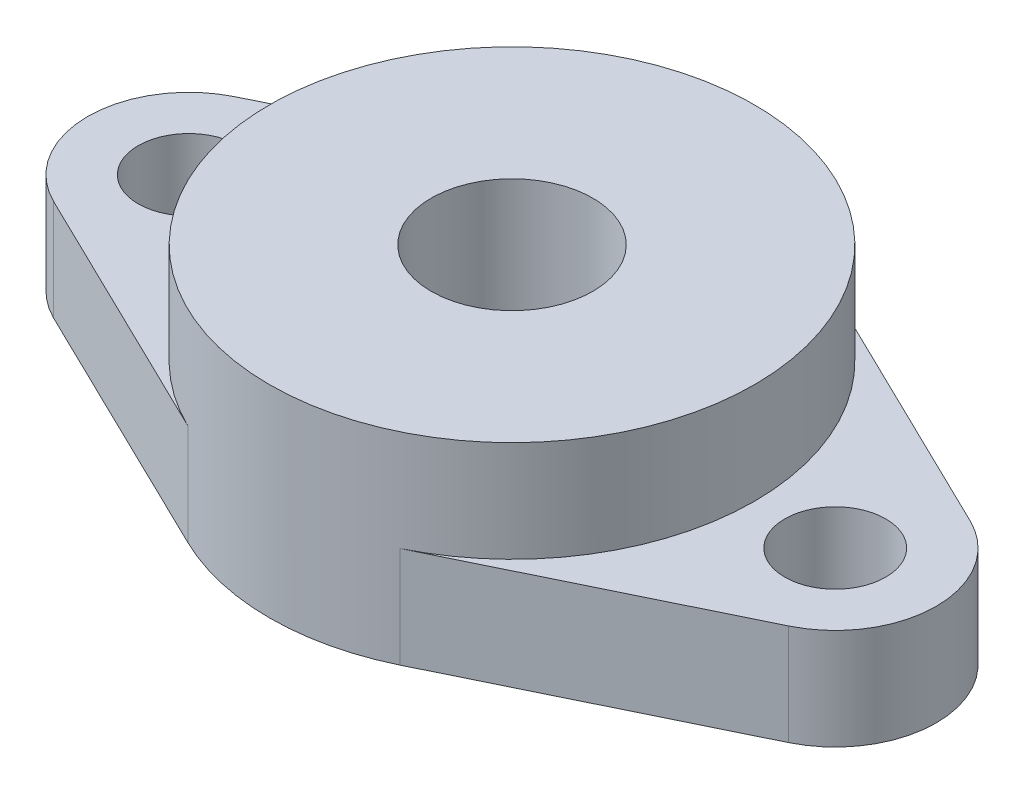
ISO-10303-21;
HEADER;
FILE_DESCRIPTION(('STEP AP214'),'2;1');
FILE_NAME('part.step','',(''),(''),'','','');
FILE_SCHEMA(('AUTOMOTIVE_DESIGN { 1 0 10303 214 1 1 1 1 }'));
ENDSEC;
DATA;
#1=APPLICATION_CONTEXT('core data for automotive mechanical design processes');
#2=APPLICATION_PROTOCOL_DEFINITION('international standard','automotive_design',2000,#1);
#3=PRODUCT_CONTEXT('',#1,'mechanical');
#4=PRODUCT('Part','Part','',(#3));
#5=PRODUCT_RELATED_PRODUCT_CATEGORY('part','',(#4));
#6=PRODUCT_DEFINITION_FORMATION('','',#4);
#7=PRODUCT_DEFINITION_CONTEXT('part definition',#1,'design');
#8=PRODUCT_DEFINITION('design','',#6,#7);
#9=PRODUCT_DEFINITION_SHAPE('','',#8);
#10=(LENGTH_UNIT() NAMED_UNIT(*) SI_UNIT(.MILLI.,.METRE.));
#11=(NAMED_UNIT(*) PLANE_ANGLE_UNIT() SI_UNIT($,.RADIAN.));
#12=(NAMED_UNIT(*) SI_UNIT($,.STERADIAN.) SOLID_ANGLE_UNIT());
#13=UNCERTAINTY_MEASURE_WITH_UNIT(LENGTH_MEASURE(1.E-05),#10,'distance_accuracy_value','');
#14=(GEOMETRIC_REPRESENTATION_CONTEXT(3) GLOBAL_UNCERTAINTY_ASSIGNED_CONTEXT((#13)) GLOBAL_UNIT_ASSIGNED_CONTEXT((#10,
#11,#12)) REPRESENTATION_CONTEXT('',''));
#15=CARTESIAN_POINT('',(0.,0.,0.));
#16=DIRECTION('',(0.,0.,1.));
#17=DIRECTION('',(1.,0.,0.));
#18=AXIS2_PLACEMENT_3D('',#15,#16,#17);
#19=CARTESIAN_POINT('',(0.,5.,0.));
#20=DIRECTION('',(0.,1.,0.));
#21=DIRECTION('',(0.,0.,1.));
#22=AXIS2_PLACEMENT_3D('',#19,#20,#21);
#23=PLANE('',#22);
#24=CARTESIAN_POINT('',(16.,5.,0.));
#25=DIRECTION('',(0.,1.,0.));
#26=DIRECTION('',(0.,0.,1.));
#27=AXIS2_PLACEMENT_3D('',#24,#25,#26);
#28=CIRCLE('',#27,2.5);
#29=CARTESIAN_POINT('',(16.,5.,2.5));
#30=VERTEX_POINT('',#29);
#31=EDGE_CURVE('E225',#30,#30,#28,.T.);
#32=ORIENTED_EDGE('',*,*,#31,.F.);
#33=EDGE_LOOP('',(#32));
#34=FACE_BOUND('',#33,.T.);
#35=CARTESIAN_POINT('',(0.,5.,0.));
#36=DIRECTION('',(0.,1.,0.));
#37=DIRECTION('',(0.,0.,1.));
#38=AXIS2_PLACEMENT_3D('',#35,#36,#37);
#39=CIRCLE('',#38,12.);
#40=CARTESIAN_POINT('',(5.25,5.,10.7906209274536));
#41=VERTEX_POINT('',#40);
#42=CARTESIAN_POINT('',(5.25,5.,-10.7906209274536));
#43=VERTEX_POINT('',#42);
#44=EDGE_CURVE('E51',#41,#43,#39,.T.);
#45=ORIENTED_EDGE('',*,*,#44,.F.);
#46=DIRECTION('',(0.899218410621135,0.,-0.4375));
#47=VECTOR('',#46,1.);
#48=CARTESIAN_POINT('',(18.1875,5.,4.49609205310567));
#49=LINE('',#48,#47);
#50=CARTESIAN_POINT('',(18.1875,5.,4.49609205310567));
#51=VERTEX_POINT('',#50);
#52=EDGE_CURVE('E113',#41,#51,#49,.T.);
#53=ORIENTED_EDGE('',*,*,#52,.T.);
#54=CARTESIAN_POINT('',(16.,5.,0.));
#55=DIRECTION('',(0.,1.,0.));
#56=DIRECTION('',(0.,0.,-1.));
#57=AXIS2_PLACEMENT_3D('',#54,#55,#56);
#58=CIRCLE('',#57,5.);
#59=CARTESIAN_POINT('',(18.1875,5.,-4.49609205310567));
#60=VERTEX_POINT('',#59);
#61=EDGE_CURVE('E116',#51,#60,#58,.T.);
#62=ORIENTED_EDGE('',*,*,#61,.T.);
#63=DIRECTION('',(-0.899218410621135,0.,-0.4375));
#64=VECTOR('',#63,1.);
#65=CARTESIAN_POINT('',(5.25,5.,-10.7906209274536));
#66=LINE('',#65,#64);
#67=EDGE_CURVE('E59',#60,#43,#66,.T.);
#68=ORIENTED_EDGE('',*,*,#67,.T.);
#69=EDGE_LOOP('',(#45,#53,#62,#68));
#70=FACE_BOUND('',#69,.T.);
#71=ADVANCED_FACE('F39',(#34,#70),#23,.T.);
#72=CARTESIAN_POINT('',(-5.25,5.,-10.7906209274536));
#73=DIRECTION('',(0.4375,0.,0.899218410621135));
#74=DIRECTION('',(0.899218410621135,0.,-0.4375));
#75=AXIS2_PLACEMENT_3D('',#72,#73,#74);
#76=PLANE('',#75);
#77=DIRECTION('',(-0.899218410621135,0.,0.4375));
#78=VECTOR('',#77,1.);
#79=CARTESIAN_POINT('',(-5.25,0.,-10.7906209274536));
#80=LINE('',#79,#78);
#81=CARTESIAN_POINT('',(-5.25,0.,-10.7906209274536));
#82=VERTEX_POINT('',#81);
#83=CARTESIAN_POINT('',(-18.1875,0.,-4.49609205310567));
#84=VERTEX_POINT('',#83);
#85=EDGE_CURVE('E144',#82,#84,#80,.T.);
#86=ORIENTED_EDGE('',*,*,#85,.T.);
#87=DIRECTION('',(0.,-1.,0.));
#88=VECTOR('',#87,1.);
#89=CARTESIAN_POINT('',(-18.1875,5.,-4.49609205310567));
#90=LINE('',#89,#88);
#91=CARTESIAN_POINT('',(-18.1875,5.,-4.49609205310567));
#92=VERTEX_POINT('',#91);
#93=EDGE_CURVE('E177',#92,#84,#90,.T.);
#94=ORIENTED_EDGE('',*,*,#93,.F.);
#95=DIRECTION('',(-0.899218410621135,0.,0.4375));
#96=VECTOR('',#95,1.);
#97=CARTESIAN_POINT('',(-5.25,5.,-10.7906209274536));
#98=LINE('',#97,#96);
#99=CARTESIAN_POINT('',(-5.25,5.,-10.7906209274536));
#100=VERTEX_POINT('',#99);
#101=EDGE_CURVE('E163',#100,#92,#98,.T.);
#102=ORIENTED_EDGE('',*,*,#101,.F.);
#103=DIRECTION('',(0.,-1.,0.));
#104=VECTOR('',#103,1.);
#105=CARTESIAN_POINT('',(-5.25,5.,-10.7906209274536));
#106=LINE('',#105,#104);
#107=EDGE_CURVE('E43',#100,#82,#106,.T.);
#108=ORIENTED_EDGE('',*,*,#107,.T.);
#109=EDGE_LOOP('',(#86,#94,#102,#108));
#110=FACE_BOUND('',#109,.T.);
#111=ADVANCED_FACE('F41',(#110),#76,.F.);
#112=CARTESIAN_POINT('',(-16.,5.,0.));
#113=DIRECTION('',(0.,-1.,0.));
#114=DIRECTION('',(0.,0.,-1.));
#115=AXIS2_PLACEMENT_3D('',#112,#113,#114);
#116=CYLINDRICAL_SURFACE('',#115,5.);
#117=CARTESIAN_POINT('',(-16.,0.,0.));
#118=DIRECTION('',(0.,1.,0.));
#119=DIRECTION('',(0.,0.,1.));
#120=AXIS2_PLACEMENT_3D('',#117,#118,#119);
#121=CIRCLE('',#120,5.);
#122=CARTESIAN_POINT('',(-18.1875,0.,4.49609205310567));
#123=VERTEX_POINT('',#122);
#124=EDGE_CURVE('E148',#84,#123,#121,.T.);
#125=ORIENTED_EDGE('',*,*,#124,.T.);
#126=DIRECTION('',(0.,-1.,0.));
#127=VECTOR('',#126,1.);
#128=CARTESIAN_POINT('',(-18.1875,5.,4.49609205310567));
#129=LINE('',#128,#127);
#130=CARTESIAN_POINT('',(-18.1875,5.,4.49609205310567));
#131=VERTEX_POINT('',#130);
#132=EDGE_CURVE('E174',#131,#123,#129,.T.);
#133=ORIENTED_EDGE('',*,*,#132,.F.);
#134=CARTESIAN_POINT('',(-16.,5.,0.));
#135=DIRECTION('',(0.,1.,0.));
#136=DIRECTION('',(0.,0.,1.));
#137=AXIS2_PLACEMENT_3D('',#134,#135,#136);
#138=CIRCLE('',#137,5.);
#139=EDGE_CURVE('E203',#92,#131,#138,.T.);
#140=ORIENTED_EDGE('',*,*,#139,.F.);
#141=ORIENTED_EDGE('',*,*,#93,.T.);
#142=EDGE_LOOP('',(#125,#133,#140,#141));
#143=FACE_BOUND('',#142,.T.);
#144=ADVANCED_FACE('F197',(#143),#116,.T.);
#145=CARTESIAN_POINT('',(-18.1875,5.,4.49609205310567));
#146=DIRECTION('',(0.4375,0.,-0.899218410621135));
#147=DIRECTION('',(-0.899218410621135,0.,-0.4375));
#148=AXIS2_PLACEMENT_3D('',#145,#146,#147);
#149=PLANE('',#148);
#150=DIRECTION('',(0.899218410621135,0.,0.4375));
#151=VECTOR('',#150,1.);
#152=CARTESIAN_POINT('',(-18.1875,0.,4.49609205310567));
#153=LINE('',#152,#151);
#154=CARTESIAN_POINT('',(-5.25,0.,10.7906209274536));
#155=VERTEX_POINT('',#154);
#156=EDGE_CURVE('E151',#123,#155,#153,.T.);
#157=ORIENTED_EDGE('',*,*,#156,.T.);
#158=DIRECTION('',(0.,-1.,0.));
#159=VECTOR('',#158,1.);
#160=CARTESIAN_POINT('',(-5.25,5.,10.7906209274536));
#161=LINE('',#160,#159);
#162=CARTESIAN_POINT('',(-5.25,5.,10.7906209274536));
#163=VERTEX_POINT('',#162);
#164=EDGE_CURVE('E170',#163,#155,#161,.T.);
#165=ORIENTED_EDGE('',*,*,#164,.F.);
#166=DIRECTION('',(0.899218410621135,0.,0.4375));
#167=VECTOR('',#166,1.);
#168=CARTESIAN_POINT('',(-18.1875,5.,4.49609205310567));
#169=LINE('',#168,#167);
#170=EDGE_CURVE('E122',#131,#163,#169,.T.);
#171=ORIENTED_EDGE('',*,*,#170,.F.);
#172=ORIENTED_EDGE('',*,*,#132,.T.);
#173=EDGE_LOOP('',(#157,#165,#171,#172));
#174=FACE_BOUND('',#173,.T.);
#175=ADVANCED_FACE('F200',(#174),#149,.F.);
#176=CARTESIAN_POINT('',(0.,5.,0.));
#177=DIRECTION('',(0.,-1.,0.));
#178=DIRECTION('',(0.,0.,-1.));
#179=AXIS2_PLACEMENT_3D('',#176,#177,#178);
#180=CYLINDRICAL_SURFACE('',#179,12.);
#181=CARTESIAN_POINT('',(0.,0.,0.));
#182=DIRECTION('',(0.,1.,0.));
#183=DIRECTION('',(0.,0.,1.));
#184=AXIS2_PLACEMENT_3D('',#181,#182,#183);
#185=CIRCLE('',#184,12.);
#186=CARTESIAN_POINT('',(5.25,0.,10.7906209274536));
#187=VERTEX_POINT('',#186);
#188=EDGE_CURVE('E154',#155,#187,#185,.T.);
#189=ORIENTED_EDGE('',*,*,#188,.T.);
#190=DIRECTION('',(0.,-1.,0.));
#191=VECTOR('',#190,1.);
#192=CARTESIAN_POINT('',(5.25,5.,10.7906209274536));
#193=LINE('',#192,#191);
#194=EDGE_CURVE('E129',#41,#187,#193,.T.);
#195=ORIENTED_EDGE('',*,*,#194,.F.);
#196=ORIENTED_EDGE('',*,*,#44,.T.);
#197=DIRECTION('',(0.,-1.,0.));
#198=VECTOR('',#197,1.);
#199=CARTESIAN_POINT('',(5.25,5.,-10.7906209274536));
#200=LINE('',#199,#198);
#201=CARTESIAN_POINT('',(5.25,0.,-10.7906209274536));
#202=VERTEX_POINT('',#201);
#203=EDGE_CURVE('E136',#43,#202,#200,.T.);
#204=ORIENTED_EDGE('',*,*,#203,.T.);
#205=CARTESIAN_POINT('',(0.,0.,0.));
#206=DIRECTION('',(0.,1.,0.));
#207=DIRECTION('',(0.,0.,1.));
#208=AXIS2_PLACEMENT_3D('',#205,#206,#207);
#209=CIRCLE('',#208,12.);
#210=EDGE_CURVE('E140',#202,#82,#209,.T.);
#211=ORIENTED_EDGE('',*,*,#210,.T.);
#212=ORIENTED_EDGE('',*,*,#107,.F.);
#213=EDGE_CURVE('E11',#100,#163,#39,.T.);
#214=ORIENTED_EDGE('',*,*,#213,.T.);
#215=ORIENTED_EDGE('',*,*,#164,.T.);
#216=EDGE_LOOP('',(#189,#195,#196,#204,#211,#212,#214,#215));
#217=FACE_BOUND('',#216,.T.);
#218=CARTESIAN_POINT('',(0.,10.,0.));
#219=DIRECTION('',(0.,1.,0.));
#220=DIRECTION('',(0.,0.,1.));
#221=AXIS2_PLACEMENT_3D('',#218,#219,#220);
#222=CIRCLE('',#221,12.);
#223=CARTESIAN_POINT('',(0.,10.,12.));
#224=VERTEX_POINT('',#223);
#225=EDGE_CURVE('E145',#224,#224,#222,.T.);
#226=ORIENTED_EDGE('',*,*,#225,.F.);
#227=EDGE_LOOP('',(#226));
#228=FACE_BOUND('',#227,.T.);
#229=ADVANCED_FACE('F190',(#217,#228),#180,.T.);
#230=CARTESIAN_POINT('',(18.1875,5.,4.49609205310567));
#231=DIRECTION('',(-0.4375,0.,-0.899218410621135));
#232=DIRECTION('',(-0.899218410621135,0.,0.4375));
#233=AXIS2_PLACEMENT_3D('',#230,#231,#232);
#234=PLANE('',#233);
#235=DIRECTION('',(0.899218410621135,0.,-0.4375));
#236=VECTOR('',#235,1.);
#237=CARTESIAN_POINT('',(18.1875,0.,4.49609205310567));
#238=LINE('',#237,#236);
#239=CARTESIAN_POINT('',(18.1875,0.,4.49609205310567));
#240=VERTEX_POINT('',#239);
#241=EDGE_CURVE('E127',#187,#240,#238,.T.);
#242=ORIENTED_EDGE('',*,*,#241,.T.);
#243=DIRECTION('',(0.,-1.,0.));
#244=VECTOR('',#243,1.);
#245=CARTESIAN_POINT('',(18.1875,5.,4.49609205310567));
#246=LINE('',#245,#244);
#247=EDGE_CURVE('E124',#51,#240,#246,.T.);
#248=ORIENTED_EDGE('',*,*,#247,.F.);
#249=ORIENTED_EDGE('',*,*,#52,.F.);
#250=ORIENTED_EDGE('',*,*,#194,.T.);
#251=EDGE_LOOP('',(#242,#248,#249,#250));
#252=FACE_BOUND('',#251,.T.);
#253=ADVANCED_FACE('F125',(#252),#234,.F.);
#254=CARTESIAN_POINT('',(16.,5.,0.));
#255=DIRECTION('',(0.,-1.,0.));
#256=DIRECTION('',(0.,0.,-1.));
#257=AXIS2_PLACEMENT_3D('',#254,#255,#256);
#258=CYLINDRICAL_SURFACE('',#257,5.);
#259=CARTESIAN_POINT('',(16.,0.,0.));
#260=DIRECTION('',(0.,1.,0.));
#261=DIRECTION('',(0.,0.,-1.));
#262=AXIS2_PLACEMENT_3D('',#259,#260,#261);
#263=CIRCLE('',#262,5.);
#264=CARTESIAN_POINT('',(18.1875,0.,-4.49609205310567));
#265=VERTEX_POINT('',#264);
#266=EDGE_CURVE('E89',#240,#265,#263,.T.);
#267=ORIENTED_EDGE('',*,*,#266,.T.);
#268=DIRECTION('',(0.,-1.,0.));
#269=VECTOR('',#268,1.);
#270=CARTESIAN_POINT('',(18.1875,5.,-4.49609205310567));
#271=LINE('',#270,#269);
#272=EDGE_CURVE('E130',#60,#265,#271,.T.);
#273=ORIENTED_EDGE('',*,*,#272,.F.);
#274=ORIENTED_EDGE('',*,*,#61,.F.);
#275=ORIENTED_EDGE('',*,*,#247,.T.);
#276=EDGE_LOOP('',(#267,#273,#274,#275));
#277=FACE_BOUND('',#276,.T.);
#278=ADVANCED_FACE('F132',(#277),#258,.T.);
#279=CARTESIAN_POINT('',(5.25,5.,-10.7906209274536));
#280=DIRECTION('',(-0.4375,0.,0.899218410621135));
#281=DIRECTION('',(0.899218410621135,0.,0.4375));
#282=AXIS2_PLACEMENT_3D('',#279,#280,#281);
#283=PLANE('',#282);
#284=DIRECTION('',(-0.899218410621135,0.,-0.4375));
#285=VECTOR('',#284,1.);
#286=CARTESIAN_POINT('',(5.25,0.,-10.7906209274536));
#287=LINE('',#286,#285);
#288=EDGE_CURVE('E95',#265,#202,#287,.T.);
#289=ORIENTED_EDGE('',*,*,#288,.T.);
#290=ORIENTED_EDGE('',*,*,#203,.F.);
#291=ORIENTED_EDGE('',*,*,#67,.F.);
#292=ORIENTED_EDGE('',*,*,#272,.T.);
#293=EDGE_LOOP('',(#289,#290,#291,#292));
#294=FACE_BOUND('',#293,.T.);
#295=ADVANCED_FACE('F276',(#294),#283,.F.);
#296=CARTESIAN_POINT('',(-16.,5.,0.));
#297=DIRECTION('',(0.,1.,0.));
#298=DIRECTION('',(0.,0.,1.));
#299=AXIS2_PLACEMENT_3D('',#296,#297,#298);
#300=CIRCLE('',#299,2.5);
#301=CARTESIAN_POINT('',(-16.,5.,2.5));
#302=VERTEX_POINT('',#301);
#303=EDGE_CURVE('E218',#302,#302,#300,.T.);
#304=ORIENTED_EDGE('',*,*,#303,.F.);
#305=EDGE_LOOP('',(#304));
#306=FACE_BOUND('',#305,.T.);
#307=ORIENTED_EDGE('',*,*,#213,.F.);
#308=ORIENTED_EDGE('',*,*,#101,.T.);
#309=ORIENTED_EDGE('',*,*,#139,.T.);
#310=ORIENTED_EDGE('',*,*,#170,.T.);
#311=EDGE_LOOP('',(#307,#308,#309,#310));
#312=FACE_BOUND('',#311,.T.);
#313=ADVANCED_FACE('F243',(#306,#312),#23,.T.);
#314=CARTESIAN_POINT('',(0.,0.,0.));
#315=DIRECTION('',(0.,1.,0.));
#316=DIRECTION('',(0.,0.,1.));
#317=AXIS2_PLACEMENT_3D('',#314,#315,#316);
#318=PLANE('',#317);
#319=CARTESIAN_POINT('',(-16.,0.,0.));
#320=DIRECTION('',(0.,-1.,0.));
#321=DIRECTION('',(0.,0.,-1.));
#322=AXIS2_PLACEMENT_3D('',#319,#320,#321);
#323=CIRCLE('',#322,2.5);
#324=CARTESIAN_POINT('',(-16.,0.,-2.5));
#325=VERTEX_POINT('',#324);
#326=EDGE_CURVE('E229',#325,#325,#323,.T.);
#327=ORIENTED_EDGE('',*,*,#326,.F.);
#328=EDGE_LOOP('',(#327));
#329=FACE_BOUND('',#328,.T.);
#330=CARTESIAN_POINT('',(16.,0.,0.));
#331=DIRECTION('',(0.,-1.,0.));
#332=DIRECTION('',(0.,0.,-1.));
#333=AXIS2_PLACEMENT_3D('',#330,#331,#332);
#334=CIRCLE('',#333,2.5);
#335=CARTESIAN_POINT('',(16.,0.,-2.5));
#336=VERTEX_POINT('',#335);
#337=EDGE_CURVE('E230',#336,#336,#334,.T.);
#338=ORIENTED_EDGE('',*,*,#337,.F.);
#339=EDGE_LOOP('',(#338));
#340=FACE_BOUND('',#339,.T.);
#341=CARTESIAN_POINT('',(0.,0.,0.));
#342=DIRECTION('',(0.,1.,0.));
#343=DIRECTION('',(0.,0.,1.));
#344=AXIS2_PLACEMENT_3D('',#341,#342,#343);
#345=CIRCLE('',#344,4.);
#346=CARTESIAN_POINT('',(0.,0.,4.));
#347=VERTEX_POINT('',#346);
#348=EDGE_CURVE('E210',#347,#347,#345,.T.);
#349=ORIENTED_EDGE('',*,*,#348,.T.);
#350=EDGE_LOOP('',(#349));
#351=FACE_BOUND('',#350,.T.);
#352=ORIENTED_EDGE('',*,*,#210,.F.);
#353=ORIENTED_EDGE('',*,*,#288,.F.);
#354=ORIENTED_EDGE('',*,*,#266,.F.);
#355=ORIENTED_EDGE('',*,*,#241,.F.);
#356=ORIENTED_EDGE('',*,*,#188,.F.);
#357=ORIENTED_EDGE('',*,*,#156,.F.);
#358=ORIENTED_EDGE('',*,*,#124,.F.);
#359=ORIENTED_EDGE('',*,*,#85,.F.);
#360=EDGE_LOOP('',(#352,#353,#354,#355,#356,#357,#358,#359));
#361=FACE_BOUND('',#360,.T.);
#362=ADVANCED_FACE('F193',(#329,#340,#351,#361),#318,.F.);
#363=CARTESIAN_POINT('',(0.,10.,0.));
#364=DIRECTION('',(0.,1.,0.));
#365=DIRECTION('',(0.,0.,1.));
#366=AXIS2_PLACEMENT_3D('',#363,#364,#365);
#367=PLANE('',#366);
#368=CARTESIAN_POINT('',(0.,10.,0.));
#369=DIRECTION('',(0.,1.,0.));
#370=DIRECTION('',(0.,0.,1.));
#371=AXIS2_PLACEMENT_3D('',#368,#369,#370);
#372=CIRCLE('',#371,4.);
#373=CARTESIAN_POINT('',(0.,10.,4.));
#374=VERTEX_POINT('',#373);
#375=EDGE_CURVE('E214',#374,#374,#372,.T.);
#376=ORIENTED_EDGE('',*,*,#375,.F.);
#377=EDGE_LOOP('',(#376));
#378=FACE_BOUND('',#377,.T.);
#379=ORIENTED_EDGE('',*,*,#225,.T.);
#380=EDGE_LOOP('',(#379));
#381=FACE_BOUND('',#380,.T.);
#382=ADVANCED_FACE('F242',(#378,#381),#367,.T.);
#383=CARTESIAN_POINT('',(0.,0.,0.));
#384=DIRECTION('',(0.,1.,0.));
#385=DIRECTION('',(0.,0.,1.));
#386=AXIS2_PLACEMENT_3D('',#383,#384,#385);
#387=CYLINDRICAL_SURFACE('',#386,4.);
#388=ORIENTED_EDGE('',*,*,#348,.F.);
#389=EDGE_LOOP('',(#388));
#390=FACE_BOUND('',#389,.T.);
#391=ORIENTED_EDGE('',*,*,#375,.T.);
#392=EDGE_LOOP('',(#391));
#393=FACE_BOUND('',#392,.T.);
#394=ADVANCED_FACE('F249',(#390,#393),#387,.F.);
#395=CARTESIAN_POINT('',(16.,10.,0.));
#396=DIRECTION('',(0.,-1.,0.));
#397=DIRECTION('',(0.,0.,-1.));
#398=AXIS2_PLACEMENT_3D('',#395,#396,#397);
#399=CYLINDRICAL_SURFACE('',#398,2.5);
#400=ORIENTED_EDGE('',*,*,#31,.T.);
#401=EDGE_LOOP('',(#400));
#402=FACE_BOUND('',#401,.T.);
#403=ORIENTED_EDGE('',*,*,#337,.T.);
#404=EDGE_LOOP('',(#403));
#405=FACE_BOUND('',#404,.T.);
#406=ADVANCED_FACE('F252',(#402,#405),#399,.F.);
#407=CARTESIAN_POINT('',(-16.,10.,0.));
#408=DIRECTION('',(0.,-1.,0.));
#409=DIRECTION('',(0.,0.,-1.));
#410=AXIS2_PLACEMENT_3D('',#407,#408,#409);
#411=CYLINDRICAL_SURFACE('',#410,2.5);
#412=ORIENTED_EDGE('',*,*,#303,.T.);
#413=EDGE_LOOP('',(#412));
#414=FACE_BOUND('',#413,.T.);
#415=ORIENTED_EDGE('',*,*,#326,.T.);
#416=EDGE_LOOP('',(#415));
#417=FACE_BOUND('',#416,.T.);
#418=ADVANCED_FACE('F238',(#414,#417),#411,.F.);
#419=CLOSED_SHELL('',(#71,#111,#144,#175,#229,#253,#278,#295,#313,#362,#382,#394,#406,#418));
#420=MANIFOLD_SOLID_BREP('B2',#419);
#421=ADVANCED_BREP_SHAPE_REPRESENTATION('',(#18,#420),#14);
#422=SHAPE_DEFINITION_REPRESENTATION(#9,#421);
ENDSEC;
END-ISO-10303-21;
